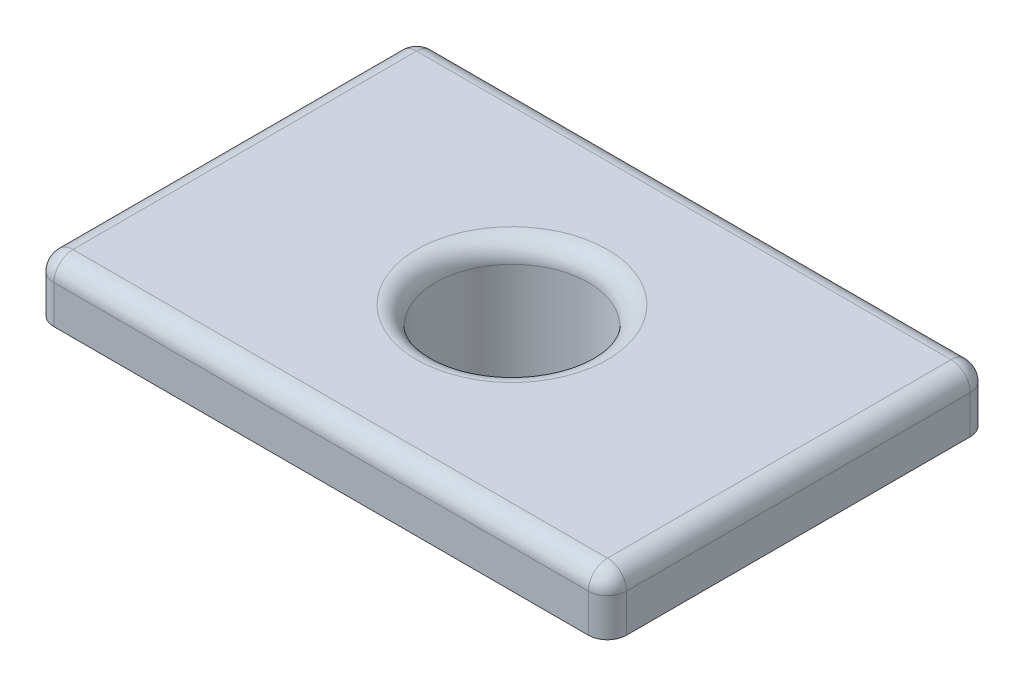
ISO-10303-21;
HEADER;
FILE_DESCRIPTION(('STEP AP214'),'2;1');
FILE_NAME('part.step','',(''),(''),'','','');
FILE_SCHEMA(('AUTOMOTIVE_DESIGN { 1 0 10303 214 1 1 1 1 }'));
ENDSEC;
DATA;
#1=APPLICATION_CONTEXT('core data for automotive mechanical design processes');
#2=APPLICATION_PROTOCOL_DEFINITION('international standard','automotive_design',2000,#1);
#3=PRODUCT_CONTEXT('',#1,'mechanical');
#4=PRODUCT('Part','Part','',(#3));
#5=PRODUCT_RELATED_PRODUCT_CATEGORY('part','',(#4));
#6=PRODUCT_DEFINITION_FORMATION('','',#4);
#7=PRODUCT_DEFINITION_CONTEXT('part definition',#1,'design');
#8=PRODUCT_DEFINITION('design','',#6,#7);
#9=PRODUCT_DEFINITION_SHAPE('','',#8);
#10=(LENGTH_UNIT() NAMED_UNIT(*) SI_UNIT(.MILLI.,.METRE.));
#11=(NAMED_UNIT(*) PLANE_ANGLE_UNIT() SI_UNIT($,.RADIAN.));
#12=(NAMED_UNIT(*) SI_UNIT($,.STERADIAN.) SOLID_ANGLE_UNIT());
#13=UNCERTAINTY_MEASURE_WITH_UNIT(LENGTH_MEASURE(1.E-05),#10,'distance_accuracy_value','');
#14=(GEOMETRIC_REPRESENTATION_CONTEXT(3) GLOBAL_UNCERTAINTY_ASSIGNED_CONTEXT((#13)) GLOBAL_UNIT_ASSIGNED_CONTEXT((#10,
#11,#12)) REPRESENTATION_CONTEXT('',''));
#15=CARTESIAN_POINT('',(0.,0.,0.));
#16=DIRECTION('',(0.,0.,1.));
#17=DIRECTION('',(1.,0.,0.));
#18=AXIS2_PLACEMENT_3D('',#15,#16,#17);
#19=CARTESIAN_POINT('',(5.73409198085028,2.95798729371791,3.05836081343341));
#20=DIRECTION('',(0.,1.,0.));
#21=DIRECTION('',(0.,0.,1.));
#22=AXIS2_PLACEMENT_3D('',#19,#20,#21);
#23=PLANE('',#22);
#24=CARTESIAN_POINT('',(5.73409198085028,2.95798729371791,3.05836081343341));
#25=DIRECTION('',(0.,1.,0.));
#26=DIRECTION('',(0.,0.,1.));
#27=AXIS2_PLACEMENT_3D('',#24,#25,#26);
#28=CIRCLE('',#27,0.5);
#29=CARTESIAN_POINT('',(5.73409198085028,2.95798729371791,3.55836081343341));
#30=VERTEX_POINT('',#29);
#31=CARTESIAN_POINT('',(6.23409198085028,2.95798729371791,3.05836081343341));
#32=VERTEX_POINT('',#31);
#33=EDGE_CURVE('E112',#30,#32,#28,.T.);
#34=ORIENTED_EDGE('',*,*,#33,.F.);
#35=DIRECTION('',(1.,0.,0.));
#36=VECTOR('',#35,1.);
#37=CARTESIAN_POINT('',(-8.26590801914972,2.95798729371791,3.55836081343341));
#38=LINE('',#37,#36);
#39=CARTESIAN_POINT('',(-8.26590801914972,2.95798729371791,3.55836081343341));
#40=VERTEX_POINT('',#39);
#41=EDGE_CURVE('E141',#40,#30,#38,.T.);
#42=ORIENTED_EDGE('',*,*,#41,.F.);
#43=CARTESIAN_POINT('',(-8.26590801914972,2.95798729371791,3.05836081343341));
#44=DIRECTION('',(0.,1.,0.));
#45=DIRECTION('',(0.,0.,1.));
#46=AXIS2_PLACEMENT_3D('',#43,#44,#45);
#47=CIRCLE('',#46,0.5);
#48=CARTESIAN_POINT('',(-8.76590801914972,2.95798729371791,3.05836081343341));
#49=VERTEX_POINT('',#48);
#50=EDGE_CURVE('E138',#49,#40,#47,.T.);
#51=ORIENTED_EDGE('',*,*,#50,.F.);
#52=DIRECTION('',(0.,0.,1.));
#53=VECTOR('',#52,1.);
#54=CARTESIAN_POINT('',(-8.76590801914972,2.95798729371791,-5.94163918656659));
#55=LINE('',#54,#53);
#56=CARTESIAN_POINT('',(-8.76590801914972,2.95798729371791,-5.94163918656659));
#57=VERTEX_POINT('',#56);
#58=EDGE_CURVE('E135',#57,#49,#55,.T.);
#59=ORIENTED_EDGE('',*,*,#58,.F.);
#60=CARTESIAN_POINT('',(-8.26590801914972,2.95798729371791,-5.94163918656659));
#61=DIRECTION('',(0.,1.,0.));
#62=DIRECTION('',(0.,0.,1.));
#63=AXIS2_PLACEMENT_3D('',#60,#61,#62);
#64=CIRCLE('',#63,0.5);
#65=CARTESIAN_POINT('',(-8.26590801914972,2.95798729371791,-6.44163918656659));
#66=VERTEX_POINT('',#65);
#67=EDGE_CURVE('E132',#66,#57,#64,.T.);
#68=ORIENTED_EDGE('',*,*,#67,.F.);
#69=DIRECTION('',(-1.,0.,0.));
#70=VECTOR('',#69,1.);
#71=CARTESIAN_POINT('',(-8.26590801914972,2.95798729371791,-6.44163918656659));
#72=LINE('',#71,#70);
#73=CARTESIAN_POINT('',(5.73409198085028,2.95798729371791,-6.44163918656659));
#74=VERTEX_POINT('',#73);
#75=EDGE_CURVE('E129',#74,#66,#72,.T.);
#76=ORIENTED_EDGE('',*,*,#75,.F.);
#77=CARTESIAN_POINT('',(5.73409198085028,2.95798729371791,-5.94163918656659));
#78=DIRECTION('',(0.,1.,0.));
#79=DIRECTION('',(0.,0.,-1.));
#80=AXIS2_PLACEMENT_3D('',#77,#78,#79);
#81=CIRCLE('',#80,0.5);
#82=CARTESIAN_POINT('',(6.23409198085028,2.95798729371791,-5.94163918656659));
#83=VERTEX_POINT('',#82);
#84=EDGE_CURVE('E115',#83,#74,#81,.T.);
#85=ORIENTED_EDGE('',*,*,#84,.F.);
#86=DIRECTION('',(0.,0.,-1.));
#87=VECTOR('',#86,1.);
#88=CARTESIAN_POINT('',(6.23409198085028,2.95798729371791,-5.94163918656659));
#89=LINE('',#88,#87);
#90=EDGE_CURVE('E98',#32,#83,#89,.T.);
#91=ORIENTED_EDGE('',*,*,#90,.F.);
#92=EDGE_LOOP('',(#34,#42,#51,#59,#68,#76,#85,#91));
#93=FACE_BOUND('',#92,.T.);
#94=CARTESIAN_POINT('',(-1.26590801914972,2.95798729371791,-1.44163918656659));
#95=DIRECTION('',(0.,1.,0.));
#96=DIRECTION('',(0.,0.,1.));
#97=AXIS2_PLACEMENT_3D('',#94,#95,#96);
#98=CIRCLE('',#97,3.);
#99=CARTESIAN_POINT('',(-1.26590801914972,2.95798729371791,1.55836081343341));
#100=VERTEX_POINT('',#99);
#101=EDGE_CURVE('E105',#100,#100,#98,.F.);
#102=ORIENTED_EDGE('',*,*,#101,.F.);
#103=EDGE_LOOP('',(#102));
#104=FACE_BOUND('',#103,.T.);
#105=ADVANCED_FACE('F16',(#93,#104),#23,.F.);
#106=CARTESIAN_POINT('',(5.73409198085028,4.45798729371791,3.05836081343341));
#107=DIRECTION('',(0.,-1.,0.));
#108=DIRECTION('',(0.,0.,-1.));
#109=AXIS2_PLACEMENT_3D('',#106,#107,#108);
#110=CYLINDRICAL_SURFACE('',#109,0.5);
#111=DIRECTION('',(0.,-1.,0.));
#112=VECTOR('',#111,1.);
#113=CARTESIAN_POINT('',(6.23409198085028,4.45798729371791,3.05836081343341));
#114=LINE('',#113,#112);
#115=CARTESIAN_POINT('',(6.23409198085028,3.95798729371791,3.05836081343341));
#116=VERTEX_POINT('',#115);
#117=EDGE_CURVE('E94',#116,#32,#114,.T.);
#118=ORIENTED_EDGE('',*,*,#117,.F.);
#119=CARTESIAN_POINT('',(5.73409198085028,3.95798729371791,3.05836081343341));
#120=DIRECTION('',(0.,-1.,0.));
#121=DIRECTION('',(0.,0.,-1.));
#122=AXIS2_PLACEMENT_3D('',#119,#120,#121);
#123=CIRCLE('',#122,0.5);
#124=CARTESIAN_POINT('',(5.73409198085028,3.95798729371791,3.55836081343341));
#125=VERTEX_POINT('',#124);
#126=EDGE_CURVE('E170',#116,#125,#123,.T.);
#127=ORIENTED_EDGE('',*,*,#126,.T.);
#128=DIRECTION('',(0.,-1.,0.));
#129=VECTOR('',#128,1.);
#130=CARTESIAN_POINT('',(5.73409198085028,4.45798729371791,3.55836081343341));
#131=LINE('',#130,#129);
#132=EDGE_CURVE('E119',#125,#30,#131,.T.);
#133=ORIENTED_EDGE('',*,*,#132,.T.);
#134=ORIENTED_EDGE('',*,*,#33,.T.);
#135=EDGE_LOOP('',(#118,#127,#133,#134));
#136=FACE_BOUND('',#135,.T.);
#137=ADVANCED_FACE('F117',(#136),#110,.T.);
#138=CARTESIAN_POINT('',(6.23409198085028,4.45798729371791,-5.94163918656659));
#139=DIRECTION('',(-1.,0.,0.));
#140=DIRECTION('',(0.,0.,1.));
#141=AXIS2_PLACEMENT_3D('',#138,#139,#140);
#142=PLANE('',#141);
#143=DIRECTION('',(0.,-1.,0.));
#144=VECTOR('',#143,1.);
#145=CARTESIAN_POINT('',(6.23409198085028,4.45798729371791,-5.94163918656659));
#146=LINE('',#145,#144);
#147=CARTESIAN_POINT('',(6.23409198085028,3.95798729371791,-5.94163918656659));
#148=VERTEX_POINT('',#147);
#149=EDGE_CURVE('E106',#148,#83,#146,.T.);
#150=ORIENTED_EDGE('',*,*,#149,.F.);
#151=DIRECTION('',(0.,0.,-1.));
#152=VECTOR('',#151,1.);
#153=CARTESIAN_POINT('',(6.23409198085028,3.95798729371791,3.05836081343341));
#154=LINE('',#153,#152);
#155=EDGE_CURVE('E101',#148,#116,#154,.F.);
#156=ORIENTED_EDGE('',*,*,#155,.T.);
#157=ORIENTED_EDGE('',*,*,#117,.T.);
#158=ORIENTED_EDGE('',*,*,#90,.T.);
#159=EDGE_LOOP('',(#150,#156,#157,#158));
#160=FACE_BOUND('',#159,.T.);
#161=ADVANCED_FACE('F97',(#160),#142,.F.);
#162=CARTESIAN_POINT('',(5.73409198085028,4.45798729371791,-5.94163918656659));
#163=DIRECTION('',(0.,-1.,0.));
#164=DIRECTION('',(0.,0.,-1.));
#165=AXIS2_PLACEMENT_3D('',#162,#163,#164);
#166=CYLINDRICAL_SURFACE('',#165,0.5);
#167=DIRECTION('',(0.,-1.,0.));
#168=VECTOR('',#167,1.);
#169=CARTESIAN_POINT('',(5.73409198085028,4.45798729371791,-6.44163918656659));
#170=LINE('',#169,#168);
#171=CARTESIAN_POINT('',(5.73409198085028,3.95798729371791,-6.44163918656659));
#172=VERTEX_POINT('',#171);
#173=EDGE_CURVE('E152',#172,#74,#170,.T.);
#174=ORIENTED_EDGE('',*,*,#173,.F.);
#175=CARTESIAN_POINT('',(5.73409198085028,3.95798729371791,-5.94163918656659));
#176=DIRECTION('',(0.,-1.,0.));
#177=DIRECTION('',(0.,0.,-1.));
#178=AXIS2_PLACEMENT_3D('',#175,#176,#177);
#179=CIRCLE('',#178,0.5);
#180=EDGE_CURVE('E157',#172,#148,#179,.T.);
#181=ORIENTED_EDGE('',*,*,#180,.T.);
#182=ORIENTED_EDGE('',*,*,#149,.T.);
#183=ORIENTED_EDGE('',*,*,#84,.T.);
#184=EDGE_LOOP('',(#174,#181,#182,#183));
#185=FACE_BOUND('',#184,.T.);
#186=ADVANCED_FACE('F245',(#185),#166,.T.);
#187=CARTESIAN_POINT('',(-8.26590801914972,4.45798729371791,-6.44163918656659));
#188=DIRECTION('',(0.,0.,1.));
#189=DIRECTION('',(1.,0.,0.));
#190=AXIS2_PLACEMENT_3D('',#187,#188,#189);
#191=PLANE('',#190);
#192=DIRECTION('',(0.,-1.,0.));
#193=VECTOR('',#192,1.);
#194=CARTESIAN_POINT('',(-8.26590801914972,4.45798729371791,-6.44163918656659));
#195=LINE('',#194,#193);
#196=CARTESIAN_POINT('',(-8.26590801914972,3.95798729371791,-6.44163918656659));
#197=VERTEX_POINT('',#196);
#198=EDGE_CURVE('E150',#197,#66,#195,.T.);
#199=ORIENTED_EDGE('',*,*,#198,.F.);
#200=DIRECTION('',(-1.,0.,0.));
#201=VECTOR('',#200,1.);
#202=CARTESIAN_POINT('',(5.73409198085028,3.95798729371791,-6.44163918656659));
#203=LINE('',#202,#201);
#204=EDGE_CURVE('E178',#197,#172,#203,.F.);
#205=ORIENTED_EDGE('',*,*,#204,.T.);
#206=ORIENTED_EDGE('',*,*,#173,.T.);
#207=ORIENTED_EDGE('',*,*,#75,.T.);
#208=EDGE_LOOP('',(#199,#205,#206,#207));
#209=FACE_BOUND('',#208,.T.);
#210=ADVANCED_FACE('F242',(#209),#191,.F.);
#211=CARTESIAN_POINT('',(-8.26590801914972,4.45798729371791,-5.94163918656659));
#212=DIRECTION('',(0.,-1.,0.));
#213=DIRECTION('',(0.,0.,-1.));
#214=AXIS2_PLACEMENT_3D('',#211,#212,#213);
#215=CYLINDRICAL_SURFACE('',#214,0.5);
#216=DIRECTION('',(0.,-1.,0.));
#217=VECTOR('',#216,1.);
#218=CARTESIAN_POINT('',(-8.76590801914972,4.45798729371791,-5.94163918656659));
#219=LINE('',#218,#217);
#220=CARTESIAN_POINT('',(-8.76590801914972,3.95798729371791,-5.94163918656659));
#221=VERTEX_POINT('',#220);
#222=EDGE_CURVE('E148',#221,#57,#219,.T.);
#223=ORIENTED_EDGE('',*,*,#222,.F.);
#224=CARTESIAN_POINT('',(-8.26590801914972,3.95798729371791,-5.94163918656659));
#225=DIRECTION('',(0.,-1.,0.));
#226=DIRECTION('',(0.,0.,-1.));
#227=AXIS2_PLACEMENT_3D('',#224,#225,#226);
#228=CIRCLE('',#227,0.5);
#229=EDGE_CURVE('E31',#221,#197,#228,.T.);
#230=ORIENTED_EDGE('',*,*,#229,.T.);
#231=ORIENTED_EDGE('',*,*,#198,.T.);
#232=ORIENTED_EDGE('',*,*,#67,.T.);
#233=EDGE_LOOP('',(#223,#230,#231,#232));
#234=FACE_BOUND('',#233,.T.);
#235=ADVANCED_FACE('F239',(#234),#215,.T.);
#236=CARTESIAN_POINT('',(-8.76590801914972,4.45798729371791,-5.94163918656659));
#237=DIRECTION('',(1.,0.,0.));
#238=DIRECTION('',(0.,0.,-1.));
#239=AXIS2_PLACEMENT_3D('',#236,#237,#238);
#240=PLANE('',#239);
#241=DIRECTION('',(0.,-1.,0.));
#242=VECTOR('',#241,1.);
#243=CARTESIAN_POINT('',(-8.76590801914972,4.45798729371791,3.05836081343341));
#244=LINE('',#243,#242);
#245=CARTESIAN_POINT('',(-8.76590801914972,3.95798729371791,3.05836081343341));
#246=VERTEX_POINT('',#245);
#247=EDGE_CURVE('E146',#246,#49,#244,.T.);
#248=ORIENTED_EDGE('',*,*,#247,.F.);
#249=DIRECTION('',(0.,0.,1.));
#250=VECTOR('',#249,1.);
#251=CARTESIAN_POINT('',(-8.76590801914972,3.95798729371791,-5.94163918656659));
#252=LINE('',#251,#250);
#253=EDGE_CURVE('E39',#246,#221,#252,.F.);
#254=ORIENTED_EDGE('',*,*,#253,.T.);
#255=ORIENTED_EDGE('',*,*,#222,.T.);
#256=ORIENTED_EDGE('',*,*,#58,.T.);
#257=EDGE_LOOP('',(#248,#254,#255,#256));
#258=FACE_BOUND('',#257,.T.);
#259=ADVANCED_FACE('F235',(#258),#240,.F.);
#260=CARTESIAN_POINT('',(-8.26590801914972,4.45798729371791,3.05836081343341));
#261=DIRECTION('',(0.,-1.,0.));
#262=DIRECTION('',(0.,0.,-1.));
#263=AXIS2_PLACEMENT_3D('',#260,#261,#262);
#264=CYLINDRICAL_SURFACE('',#263,0.5);
#265=DIRECTION('',(0.,-1.,0.));
#266=VECTOR('',#265,1.);
#267=CARTESIAN_POINT('',(-8.26590801914972,4.45798729371791,3.55836081343341));
#268=LINE('',#267,#266);
#269=CARTESIAN_POINT('',(-8.26590801914972,3.95798729371791,3.55836081343341));
#270=VERTEX_POINT('',#269);
#271=EDGE_CURVE('E144',#270,#40,#268,.T.);
#272=ORIENTED_EDGE('',*,*,#271,.F.);
#273=CARTESIAN_POINT('',(-8.26590801914972,3.95798729371791,3.05836081343341));
#274=DIRECTION('',(0.,-1.,0.));
#275=DIRECTION('',(0.,0.,-1.));
#276=AXIS2_PLACEMENT_3D('',#273,#274,#275);
#277=CIRCLE('',#276,0.5);
#278=EDGE_CURVE('E174',#270,#246,#277,.T.);
#279=ORIENTED_EDGE('',*,*,#278,.T.);
#280=ORIENTED_EDGE('',*,*,#247,.T.);
#281=ORIENTED_EDGE('',*,*,#50,.T.);
#282=EDGE_LOOP('',(#272,#279,#280,#281));
#283=FACE_BOUND('',#282,.T.);
#284=ADVANCED_FACE('F231',(#283),#264,.T.);
#285=CARTESIAN_POINT('',(-8.26590801914972,4.45798729371791,3.55836081343341));
#286=DIRECTION('',(0.,0.,-1.));
#287=DIRECTION('',(-1.,0.,0.));
#288=AXIS2_PLACEMENT_3D('',#285,#286,#287);
#289=PLANE('',#288);
#290=ORIENTED_EDGE('',*,*,#132,.F.);
#291=DIRECTION('',(1.,0.,0.));
#292=VECTOR('',#291,1.);
#293=CARTESIAN_POINT('',(-8.26590801914972,3.95798729371791,3.55836081343341));
#294=LINE('',#293,#292);
#295=EDGE_CURVE('E172',#125,#270,#294,.F.);
#296=ORIENTED_EDGE('',*,*,#295,.T.);
#297=ORIENTED_EDGE('',*,*,#271,.T.);
#298=ORIENTED_EDGE('',*,*,#41,.T.);
#299=EDGE_LOOP('',(#290,#296,#297,#298));
#300=FACE_BOUND('',#299,.T.);
#301=ADVANCED_FACE('F228',(#300),#289,.F.);
#302=CARTESIAN_POINT('',(5.73409198085028,4.45798729371791,3.05836081343341));
#303=DIRECTION('',(0.,1.,0.));
#304=DIRECTION('',(0.,0.,1.));
#305=AXIS2_PLACEMENT_3D('',#302,#303,#304);
#306=PLANE('',#305);
#307=CARTESIAN_POINT('',(-1.26590801914972,4.45798729371791,-1.44163918656659));
#308=DIRECTION('',(0.,1.,0.));
#309=DIRECTION('',(0.,0.,1.));
#310=AXIS2_PLACEMENT_3D('',#307,#308,#309);
#311=CIRCLE('',#310,2.5);
#312=CARTESIAN_POINT('',(-1.26590801914972,4.45798729371791,1.05836081343341));
#313=VERTEX_POINT('',#312);
#314=EDGE_CURVE('E10',#313,#313,#311,.F.);
#315=ORIENTED_EDGE('',*,*,#314,.T.);
#316=EDGE_LOOP('',(#315));
#317=FACE_BOUND('',#316,.T.);
#318=DIRECTION('',(1.,0.,0.));
#319=VECTOR('',#318,1.);
#320=CARTESIAN_POINT('',(5.73409198085028,4.45798729371791,3.05836081343341));
#321=LINE('',#320,#319);
#322=CARTESIAN_POINT('',(-8.26590801914972,4.45798729371791,3.05836081343341));
#323=VERTEX_POINT('',#322);
#324=CARTESIAN_POINT('',(5.73409198085028,4.45798729371791,3.05836081343341));
#325=VERTEX_POINT('',#324);
#326=EDGE_CURVE('E164',#323,#325,#321,.T.);
#327=ORIENTED_EDGE('',*,*,#326,.T.);
#328=DIRECTION('',(0.,0.,-1.));
#329=VECTOR('',#328,1.);
#330=CARTESIAN_POINT('',(5.73409198085028,4.45798729371791,-5.94163918656659));
#331=LINE('',#330,#329);
#332=CARTESIAN_POINT('',(5.73409198085028,4.45798729371791,-5.94163918656659));
#333=VERTEX_POINT('',#332);
#334=EDGE_CURVE('E166',#325,#333,#331,.T.);
#335=ORIENTED_EDGE('',*,*,#334,.T.);
#336=DIRECTION('',(-1.,0.,0.));
#337=VECTOR('',#336,1.);
#338=CARTESIAN_POINT('',(-8.26590801914972,4.45798729371791,-5.94163918656659));
#339=LINE('',#338,#337);
#340=CARTESIAN_POINT('',(-8.26590801914972,4.45798729371791,-5.94163918656659));
#341=VERTEX_POINT('',#340);
#342=EDGE_CURVE('E160',#333,#341,#339,.T.);
#343=ORIENTED_EDGE('',*,*,#342,.T.);
#344=DIRECTION('',(0.,0.,1.));
#345=VECTOR('',#344,1.);
#346=CARTESIAN_POINT('',(-8.26590801914972,4.45798729371791,3.05836081343341));
#347=LINE('',#346,#345);
#348=EDGE_CURVE('E162',#341,#323,#347,.T.);
#349=ORIENTED_EDGE('',*,*,#348,.T.);
#350=EDGE_LOOP('',(#327,#335,#343,#349));
#351=FACE_BOUND('',#350,.T.);
#352=ADVANCED_FACE('F226',(#317,#351),#306,.T.);
#353=CARTESIAN_POINT('',(-1.26590801914972,2.95798729371791,-1.44163918656659));
#354=DIRECTION('',(0.,1.,0.));
#355=DIRECTION('',(0.,0.,1.));
#356=AXIS2_PLACEMENT_3D('',#353,#354,#355);
#357=CYLINDRICAL_SURFACE('',#356,2.);
#358=CARTESIAN_POINT('',(-1.26590801914972,3.95798729371791,-1.44163918656659));
#359=DIRECTION('',(0.,1.,0.));
#360=DIRECTION('',(0.,0.,1.));
#361=AXIS2_PLACEMENT_3D('',#358,#359,#360);
#362=CIRCLE('',#361,2.);
#363=CARTESIAN_POINT('',(-1.26590801914972,3.95798729371791,0.558360813433412));
#364=VERTEX_POINT('',#363);
#365=EDGE_CURVE('E24',#364,#364,#362,.T.);
#366=ORIENTED_EDGE('',*,*,#365,.T.);
#367=EDGE_LOOP('',(#366));
#368=FACE_BOUND('',#367,.T.);
#369=CARTESIAN_POINT('',(-1.26590801914972,0.957987293717906,-1.44163918656659));
#370=DIRECTION('',(0.,-1.,0.));
#371=DIRECTION('',(0.,0.,-1.));
#372=AXIS2_PLACEMENT_3D('',#369,#370,#371);
#373=CIRCLE('',#372,2.);
#374=CARTESIAN_POINT('',(-1.26590801914972,0.957987293717906,-3.44163918656659));
#375=VERTEX_POINT('',#374);
#376=EDGE_CURVE('E124',#375,#375,#373,.T.);
#377=ORIENTED_EDGE('',*,*,#376,.T.);
#378=EDGE_LOOP('',(#377));
#379=FACE_BOUND('',#378,.T.);
#380=ADVANCED_FACE('F204',(#368,#379),#357,.F.);
#381=CARTESIAN_POINT('',(-1.26590801914972,0.957987293717906,-1.44163918656659));
#382=DIRECTION('',(0.,-1.,0.));
#383=DIRECTION('',(0.,0.,-1.));
#384=AXIS2_PLACEMENT_3D('',#381,#382,#383);
#385=PLANE('',#384);
#386=CARTESIAN_POINT('',(-1.26590801914972,0.957987293717906,-1.44163918656659));
#387=DIRECTION('',(0.,-1.,0.));
#388=DIRECTION('',(0.,0.,-1.));
#389=AXIS2_PLACEMENT_3D('',#386,#387,#388);
#390=CIRCLE('',#389,3.);
#391=CARTESIAN_POINT('',(-1.26590801914972,0.957987293717906,-4.44163918656659));
#392=VERTEX_POINT('',#391);
#393=EDGE_CURVE('E121',#392,#392,#390,.T.);
#394=ORIENTED_EDGE('',*,*,#393,.T.);
#395=EDGE_LOOP('',(#394));
#396=FACE_BOUND('',#395,.T.);
#397=ORIENTED_EDGE('',*,*,#376,.F.);
#398=EDGE_LOOP('',(#397));
#399=FACE_BOUND('',#398,.T.);
#400=ADVANCED_FACE('F281',(#396,#399),#385,.T.);
#401=CARTESIAN_POINT('',(-1.26590801914972,0.957987293717906,-1.44163918656659));
#402=DIRECTION('',(0.,1.,0.));
#403=DIRECTION('',(0.,0.,1.));
#404=AXIS2_PLACEMENT_3D('',#401,#402,#403);
#405=CYLINDRICAL_SURFACE('',#404,3.);
#406=ORIENTED_EDGE('',*,*,#393,.F.);
#407=EDGE_LOOP('',(#406));
#408=FACE_BOUND('',#407,.T.);
#409=ORIENTED_EDGE('',*,*,#101,.T.);
#410=EDGE_LOOP('',(#409));
#411=FACE_BOUND('',#410,.T.);
#412=ADVANCED_FACE('F276',(#408,#411),#405,.T.);
#413=CARTESIAN_POINT('',(-8.26590801914972,3.95798729371791,3.05836081343341));
#414=DIRECTION('',(0.,0.,1.));
#415=DIRECTION('',(1.,0.,0.));
#416=AXIS2_PLACEMENT_3D('',#413,#414,#415);
#417=SPHERICAL_SURFACE('',#416,0.5);
#418=CARTESIAN_POINT('',(-8.26590801914972,3.95798729371791,3.05836081343341));
#419=DIRECTION('',(0.,0.,-1.));
#420=DIRECTION('',(-1.,0.,0.));
#421=AXIS2_PLACEMENT_3D('',#418,#419,#420);
#422=CIRCLE('',#421,0.5);
#423=EDGE_CURVE('E196',#246,#323,#422,.T.);
#424=ORIENTED_EDGE('',*,*,#423,.F.);
#425=ORIENTED_EDGE('',*,*,#278,.F.);
#426=CARTESIAN_POINT('',(-8.26590801914972,3.95798729371791,3.05836081343341));
#427=DIRECTION('',(1.,0.,0.));
#428=DIRECTION('',(0.,0.,-1.));
#429=AXIS2_PLACEMENT_3D('',#426,#427,#428);
#430=CIRCLE('',#429,0.5);
#431=EDGE_CURVE('E199',#323,#270,#430,.T.);
#432=ORIENTED_EDGE('',*,*,#431,.F.);
#433=EDGE_LOOP('',(#424,#425,#432));
#434=FACE_BOUND('',#433,.T.);
#435=ADVANCED_FACE('F273',(#434),#417,.T.);
#436=CARTESIAN_POINT('',(5.73409198085028,3.95798729371791,3.05836081343341));
#437=DIRECTION('',(-1.,0.,0.));
#438=DIRECTION('',(0.,0.,1.));
#439=AXIS2_PLACEMENT_3D('',#436,#437,#438);
#440=CYLINDRICAL_SURFACE('',#439,0.5);
#441=ORIENTED_EDGE('',*,*,#431,.T.);
#442=ORIENTED_EDGE('',*,*,#295,.F.);
#443=CARTESIAN_POINT('',(5.73409198085028,3.95798729371791,3.05836081343341));
#444=DIRECTION('',(1.,0.,0.));
#445=DIRECTION('',(0.,0.,-1.));
#446=AXIS2_PLACEMENT_3D('',#443,#444,#445);
#447=CIRCLE('',#446,0.5);
#448=EDGE_CURVE('E193',#325,#125,#447,.T.);
#449=ORIENTED_EDGE('',*,*,#448,.F.);
#450=ORIENTED_EDGE('',*,*,#326,.F.);
#451=EDGE_LOOP('',(#441,#442,#449,#450));
#452=FACE_BOUND('',#451,.T.);
#453=ADVANCED_FACE('F270',(#452),#440,.T.);
#454=CARTESIAN_POINT('',(-8.26590801914972,3.95798729371791,3.05836081343341));
#455=DIRECTION('',(0.,0.,-1.));
#456=DIRECTION('',(-1.,0.,0.));
#457=AXIS2_PLACEMENT_3D('',#454,#455,#456);
#458=CYLINDRICAL_SURFACE('',#457,0.5);
#459=ORIENTED_EDGE('',*,*,#423,.T.);
#460=ORIENTED_EDGE('',*,*,#348,.F.);
#461=CARTESIAN_POINT('',(-8.26590801914972,3.95798729371791,-5.94163918656659));
#462=DIRECTION('',(0.,0.,-1.));
#463=DIRECTION('',(-1.,0.,0.));
#464=AXIS2_PLACEMENT_3D('',#461,#462,#463);
#465=CIRCLE('',#464,0.5);
#466=EDGE_CURVE('E190',#221,#341,#465,.T.);
#467=ORIENTED_EDGE('',*,*,#466,.F.);
#468=ORIENTED_EDGE('',*,*,#253,.F.);
#469=EDGE_LOOP('',(#459,#460,#467,#468));
#470=FACE_BOUND('',#469,.T.);
#471=ADVANCED_FACE('F266',(#470),#458,.T.);
#472=CARTESIAN_POINT('',(5.73409198085028,3.95798729371791,3.05836081343341));
#473=DIRECTION('',(0.,0.,1.));
#474=DIRECTION('',(1.,0.,0.));
#475=AXIS2_PLACEMENT_3D('',#472,#473,#474);
#476=SPHERICAL_SURFACE('',#475,0.5);
#477=ORIENTED_EDGE('',*,*,#448,.T.);
#478=ORIENTED_EDGE('',*,*,#126,.F.);
#479=CARTESIAN_POINT('',(5.73409198085028,3.95798729371791,3.05836081343341));
#480=DIRECTION('',(0.,0.,-1.));
#481=DIRECTION('',(-1.,0.,0.));
#482=AXIS2_PLACEMENT_3D('',#479,#480,#481);
#483=CIRCLE('',#482,0.5);
#484=EDGE_CURVE('E187',#325,#116,#483,.T.);
#485=ORIENTED_EDGE('',*,*,#484,.F.);
#486=EDGE_LOOP('',(#477,#478,#485));
#487=FACE_BOUND('',#486,.T.);
#488=ADVANCED_FACE('F262',(#487),#476,.T.);
#489=CARTESIAN_POINT('',(-8.26590801914972,3.95798729371791,-5.94163918656659));
#490=DIRECTION('',(0.,0.,1.));
#491=DIRECTION('',(1.,0.,0.));
#492=AXIS2_PLACEMENT_3D('',#489,#490,#491);
#493=SPHERICAL_SURFACE('',#492,0.5);
#494=ORIENTED_EDGE('',*,*,#229,.F.);
#495=ORIENTED_EDGE('',*,*,#466,.T.);
#496=CARTESIAN_POINT('',(-8.26590801914972,3.95798729371791,-5.94163918656659));
#497=DIRECTION('',(1.,0.,0.));
#498=DIRECTION('',(0.,0.,-1.));
#499=AXIS2_PLACEMENT_3D('',#496,#497,#498);
#500=CIRCLE('',#499,0.5);
#501=EDGE_CURVE('E184',#197,#341,#500,.T.);
#502=ORIENTED_EDGE('',*,*,#501,.F.);
#503=EDGE_LOOP('',(#494,#495,#502));
#504=FACE_BOUND('',#503,.T.);
#505=ADVANCED_FACE('F258',(#504),#493,.T.);
#506=CARTESIAN_POINT('',(5.73409198085028,3.95798729371791,3.05836081343341));
#507=DIRECTION('',(0.,0.,1.));
#508=DIRECTION('',(1.,0.,0.));
#509=AXIS2_PLACEMENT_3D('',#506,#507,#508);
#510=CYLINDRICAL_SURFACE('',#509,0.5);
#511=ORIENTED_EDGE('',*,*,#484,.T.);
#512=ORIENTED_EDGE('',*,*,#155,.F.);
#513=CARTESIAN_POINT('',(5.73409198085028,3.95798729371791,-5.94163918656659));
#514=DIRECTION('',(0.,0.,-1.));
#515=DIRECTION('',(-1.,0.,0.));
#516=AXIS2_PLACEMENT_3D('',#513,#514,#515);
#517=CIRCLE('',#516,0.5);
#518=EDGE_CURVE('E182',#333,#148,#517,.T.);
#519=ORIENTED_EDGE('',*,*,#518,.F.);
#520=ORIENTED_EDGE('',*,*,#334,.F.);
#521=EDGE_LOOP('',(#511,#512,#519,#520));
#522=FACE_BOUND('',#521,.T.);
#523=ADVANCED_FACE('F254',(#522),#510,.T.);
#524=CARTESIAN_POINT('',(5.73409198085028,3.95798729371791,-5.94163918656659));
#525=DIRECTION('',(1.,0.,0.));
#526=DIRECTION('',(0.,0.,-1.));
#527=AXIS2_PLACEMENT_3D('',#524,#525,#526);
#528=CYLINDRICAL_SURFACE('',#527,0.5);
#529=ORIENTED_EDGE('',*,*,#501,.T.);
#530=ORIENTED_EDGE('',*,*,#342,.F.);
#531=CARTESIAN_POINT('',(5.73409198085028,3.95798729371791,-5.94163918656659));
#532=DIRECTION('',(1.,0.,0.));
#533=DIRECTION('',(0.,1.,0.));
#534=AXIS2_PLACEMENT_3D('',#531,#532,#533);
#535=CIRCLE('',#534,0.5);
#536=EDGE_CURVE('E180',#172,#333,#535,.T.);
#537=ORIENTED_EDGE('',*,*,#536,.F.);
#538=ORIENTED_EDGE('',*,*,#204,.F.);
#539=EDGE_LOOP('',(#529,#530,#537,#538));
#540=FACE_BOUND('',#539,.T.);
#541=ADVANCED_FACE('F214',(#540),#528,.T.);
#542=CARTESIAN_POINT('',(5.73409198085028,3.95798729371791,-5.94163918656659));
#543=DIRECTION('',(0.,0.,1.));
#544=DIRECTION('',(1.,0.,0.));
#545=AXIS2_PLACEMENT_3D('',#542,#543,#544);
#546=SPHERICAL_SURFACE('',#545,0.5);
#547=ORIENTED_EDGE('',*,*,#518,.T.);
#548=ORIENTED_EDGE('',*,*,#180,.F.);
#549=ORIENTED_EDGE('',*,*,#536,.T.);
#550=EDGE_LOOP('',(#547,#548,#549));
#551=FACE_BOUND('',#550,.T.);
#552=ADVANCED_FACE('F208',(#551),#546,.T.);
#553=CARTESIAN_POINT('',(-1.26590801914972,3.95798729371791,-1.44163918656659));
#554=DIRECTION('',(0.,1.,0.));
#555=DIRECTION('',(0.,0.,1.));
#556=AXIS2_PLACEMENT_3D('',#553,#554,#555);
#557=TOROIDAL_SURFACE('',#556,2.5,0.5);
#558=ORIENTED_EDGE('',*,*,#314,.F.);
#559=EDGE_LOOP('',(#558));
#560=FACE_BOUND('',#559,.T.);
#561=ORIENTED_EDGE('',*,*,#365,.F.);
#562=EDGE_LOOP('',(#561));
#563=FACE_BOUND('',#562,.T.);
#564=ADVANCED_FACE('F18',(#560,#563),#557,.T.);
#565=CLOSED_SHELL('',(#105,#137,#161,#186,#210,#235,#259,#284,#301,#352,#380,#400,#412,#435,
#453,#471,#488,#505,#523,#541,#552,#564));
#566=MANIFOLD_SOLID_BREP('B1',#565);
#567=ADVANCED_BREP_SHAPE_REPRESENTATION('',(#18,#566),#14);
#568=SHAPE_DEFINITION_REPRESENTATION(#9,#567);
ENDSEC;
END-ISO-10303-21;
